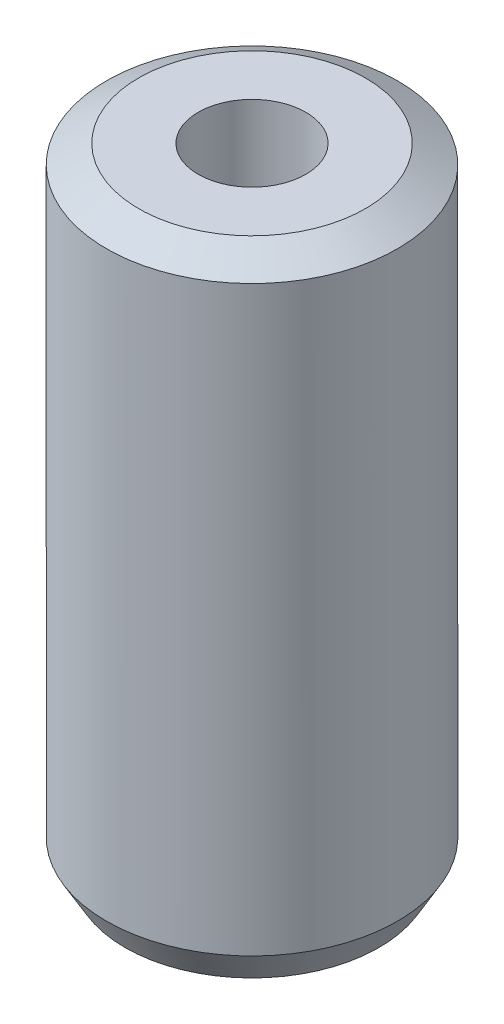
ISO-10303-21;
HEADER;
FILE_DESCRIPTION(('STEP AP214'),'2;1');
FILE_NAME('part.step','',(''),(''),'','','');
FILE_SCHEMA(('AUTOMOTIVE_DESIGN { 1 0 10303 214 1 1 1 1 }'));
ENDSEC;
DATA;
#1=APPLICATION_CONTEXT('core data for automotive mechanical design processes');
#2=APPLICATION_PROTOCOL_DEFINITION('international standard','automotive_design',2000,#1);
#3=PRODUCT_CONTEXT('',#1,'mechanical');
#4=PRODUCT('Part','Part','',(#3));
#5=PRODUCT_RELATED_PRODUCT_CATEGORY('part','',(#4));
#6=PRODUCT_DEFINITION_FORMATION('','',#4);
#7=PRODUCT_DEFINITION_CONTEXT('part definition',#1,'design');
#8=PRODUCT_DEFINITION('design','',#6,#7);
#9=PRODUCT_DEFINITION_SHAPE('','',#8);
#10=(LENGTH_UNIT() NAMED_UNIT(*) SI_UNIT(.MILLI.,.METRE.));
#11=(NAMED_UNIT(*) PLANE_ANGLE_UNIT() SI_UNIT($,.RADIAN.));
#12=(NAMED_UNIT(*) SI_UNIT($,.STERADIAN.) SOLID_ANGLE_UNIT());
#13=UNCERTAINTY_MEASURE_WITH_UNIT(LENGTH_MEASURE(1.E-05),#10,'distance_accuracy_value','');
#14=(GEOMETRIC_REPRESENTATION_CONTEXT(3) GLOBAL_UNCERTAINTY_ASSIGNED_CONTEXT((#13)) GLOBAL_UNIT_ASSIGNED_CONTEXT((#10,
#11,#12)) REPRESENTATION_CONTEXT('',''));
#15=CARTESIAN_POINT('',(0.,0.,0.));
#16=DIRECTION('',(0.,0.,1.));
#17=DIRECTION('',(1.,0.,0.));
#18=AXIS2_PLACEMENT_3D('',#15,#16,#17);
#19=CARTESIAN_POINT('',(0.,65.2591852957478,0.));
#20=DIRECTION('',(0.,-1.,0.));
#21=DIRECTION('',(0.,0.,-1.));
#22=AXIS2_PLACEMENT_3D('',#19,#20,#21);
#23=CYLINDRICAL_SURFACE('',#22,15.);
#24=CARTESIAN_POINT('',(0.,63.3434312101583,0.));
#25=DIRECTION('',(0.,1.,0.));
#26=DIRECTION('',(0.,0.,1.));
#27=AXIS2_PLACEMENT_3D('',#24,#25,#26);
#28=CIRCLE('',#27,15.);
#29=CARTESIAN_POINT('',(0.,63.3434312101582,-15.));
#30=VERTEX_POINT('',#29);
#31=EDGE_CURVE('E50',#30,#30,#28,.F.);
#32=ORIENTED_EDGE('',*,*,#31,.T.);
#33=EDGE_LOOP('',(#32));
#34=FACE_BOUND('',#33,.T.);
#35=CARTESIAN_POINT('',(0.,3.31818341104873,0.));
#36=DIRECTION('',(0.,1.,0.));
#37=DIRECTION('',(0.,0.,1.));
#38=AXIS2_PLACEMENT_3D('',#35,#36,#37);
#39=CIRCLE('',#38,15.);
#40=CARTESIAN_POINT('',(0.,3.31818341104873,15.));
#41=VERTEX_POINT('',#40);
#42=EDGE_CURVE('E51',#41,#41,#39,.T.);
#43=ORIENTED_EDGE('',*,*,#42,.T.);
#44=EDGE_LOOP('',(#43));
#45=FACE_BOUND('',#44,.T.);
#46=ADVANCED_FACE('F39',(#34,#45),#23,.T.);
#47=CARTESIAN_POINT('',(0.,65.2591852957478,0.));
#48=DIRECTION('',(0.,1.,0.));
#49=DIRECTION('',(0.,0.,1.));
#50=AXIS2_PLACEMENT_3D('',#47,#48,#49);
#51=PLANE('',#50);
#52=CARTESIAN_POINT('',(0.,65.2591852957478,0.));
#53=DIRECTION('',(0.,1.,0.));
#54=DIRECTION('',(0.,0.,1.));
#55=AXIS2_PLACEMENT_3D('',#52,#53,#54);
#56=CIRCLE('',#55,11.6818165889513);
#57=CARTESIAN_POINT('',(0.,65.2591852957478,-11.6818165889513));
#58=VERTEX_POINT('',#57);
#59=EDGE_CURVE('E54',#58,#58,#56,.T.);
#60=ORIENTED_EDGE('',*,*,#59,.T.);
#61=EDGE_LOOP('',(#60));
#62=FACE_BOUND('',#61,.T.);
#63=CARTESIAN_POINT('',(0.,65.2591852957478,0.));
#64=DIRECTION('',(0.,1.,0.));
#65=DIRECTION('',(0.,0.,1.));
#66=AXIS2_PLACEMENT_3D('',#63,#64,#65);
#67=CIRCLE('',#66,5.54728378747253);
#68=CARTESIAN_POINT('',(0.,65.2591852957478,5.54728378747253));
#69=VERTEX_POINT('',#68);
#70=EDGE_CURVE('E58',#69,#69,#67,.T.);
#71=ORIENTED_EDGE('',*,*,#70,.F.);
#72=EDGE_LOOP('',(#71));
#73=FACE_BOUND('',#72,.T.);
#74=ADVANCED_FACE('F69',(#62,#73),#51,.T.);
#75=CARTESIAN_POINT('',(0.,0.,0.));
#76=DIRECTION('',(0.,1.,0.));
#77=DIRECTION('',(0.,0.,1.));
#78=AXIS2_PLACEMENT_3D('',#75,#76,#77);
#79=PLANE('',#78);
#80=CARTESIAN_POINT('',(0.,0.,0.));
#81=DIRECTION('',(0.,1.,0.));
#82=DIRECTION('',(0.,0.,1.));
#83=AXIS2_PLACEMENT_3D('',#80,#81,#82);
#84=CIRCLE('',#83,13.0842459144105);
#85=CARTESIAN_POINT('',(0.,0.,13.0842459144105));
#86=VERTEX_POINT('',#85);
#87=EDGE_CURVE('E10',#86,#86,#84,.F.);
#88=ORIENTED_EDGE('',*,*,#87,.T.);
#89=EDGE_LOOP('',(#88));
#90=FACE_BOUND('',#89,.T.);
#91=CARTESIAN_POINT('',(0.,0.,0.));
#92=DIRECTION('',(0.,1.,0.));
#93=DIRECTION('',(0.,0.,1.));
#94=AXIS2_PLACEMENT_3D('',#91,#92,#93);
#95=CIRCLE('',#94,5.54728378747253);
#96=CARTESIAN_POINT('',(0.,0.,5.54728378747253));
#97=VERTEX_POINT('',#96);
#98=EDGE_CURVE('E63',#97,#97,#95,.T.);
#99=ORIENTED_EDGE('',*,*,#98,.T.);
#100=EDGE_LOOP('',(#99));
#101=FACE_BOUND('',#100,.T.);
#102=ADVANCED_FACE('F75',(#90,#101),#79,.F.);
#103=CARTESIAN_POINT('',(0.,65.2591852957478,0.));
#104=DIRECTION('',(0.,-1.,0.));
#105=DIRECTION('',(0.,0.,-1.));
#106=AXIS2_PLACEMENT_3D('',#103,#104,#105);
#107=CYLINDRICAL_SURFACE('',#106,5.54728378747253);
#108=ORIENTED_EDGE('',*,*,#70,.T.);
#109=EDGE_LOOP('',(#108));
#110=FACE_BOUND('',#109,.T.);
#111=ORIENTED_EDGE('',*,*,#98,.F.);
#112=EDGE_LOOP('',(#111));
#113=FACE_BOUND('',#112,.T.);
#114=ADVANCED_FACE('F70',(#110,#113),#107,.F.);
#115=CARTESIAN_POINT('',(0.,65.2591852957478,0.));
#116=DIRECTION('',(0.,-1.,0.));
#117=DIRECTION('',(0.,0.,-1.));
#118=AXIS2_PLACEMENT_3D('',#115,#116,#117);
#119=CONICAL_SURFACE('',#118,11.6818165889513,1.04719755119659);
#120=CARTESIAN_POINT('',(0.,63.3434312101582,-15.));
#121=CARTESIAN_POINT('',(0.,63.3633869818831,-14.9654355894683));
#122=CARTESIAN_POINT('',(0.,63.383342753608,-14.9308711789365));
#123=CARTESIAN_POINT('',(0.,63.4232542970578,-14.861742357873));
#124=CARTESIAN_POINT('',(0.,63.4432100687827,-14.8271779473412));
#125=CARTESIAN_POINT('',(0.,63.4831216122325,-14.7580491262777));
#126=CARTESIAN_POINT('',(0.,63.5030773839574,-14.723484715746));
#127=CARTESIAN_POINT('',(0.,63.5429889274072,-14.6543558946824));
#128=CARTESIAN_POINT('',(0.,63.5629446991321,-14.6197914841507));
#129=CARTESIAN_POINT('',(0.,63.6028562425818,-14.5506626630872));
#130=CARTESIAN_POINT('',(0.,63.6228120143067,-14.5160982525554));
#131=CARTESIAN_POINT('',(0.,63.6627235577565,-14.4469694314919));
#132=CARTESIAN_POINT('',(0.,63.6826793294814,-14.4124050209601));
#133=CARTESIAN_POINT('',(0.,63.7225908729312,-14.3432761998966));
#134=CARTESIAN_POINT('',(0.,63.7425466446561,-14.3087117893649));
#135=CARTESIAN_POINT('',(0.,63.7824581881059,-14.2395829683013));
#136=CARTESIAN_POINT('',(0.,63.8024139598307,-14.2050185577696));
#137=CARTESIAN_POINT('',(0.,63.8423255032805,-14.1358897367061));
#138=CARTESIAN_POINT('',(0.,63.8622812750054,-14.1013253261743));
#139=CARTESIAN_POINT('',(0.,63.9021928184552,-14.0321965051108));
#140=CARTESIAN_POINT('',(0.,63.9221485901801,-13.997632094579));
#141=CARTESIAN_POINT('',(0.,63.9620601336299,-13.9285032735155));
#142=CARTESIAN_POINT('',(0.,63.9820159053548,-13.8939388629838));
#143=CARTESIAN_POINT('',(0.,64.0219274488046,-13.8248100419202));
#144=CARTESIAN_POINT('',(0.,64.0418832205294,-13.7902456313885));
#145=CARTESIAN_POINT('',(0.,64.0817947639792,-13.721116810325));
#146=CARTESIAN_POINT('',(0.,64.1017505357041,-13.6865523997932));
#147=CARTESIAN_POINT('',(0.,64.1416620791539,-13.6174235787297));
#148=CARTESIAN_POINT('',(0.,64.1616178508788,-13.5828591681979));
#149=CARTESIAN_POINT('',(0.,64.2015293943286,-13.5137303471344));
#150=CARTESIAN_POINT('',(0.,64.2214851660535,-13.4791659366027));
#151=CARTESIAN_POINT('',(0.,64.2613967095032,-13.4100371155392));
#152=CARTESIAN_POINT('',(0.,64.2813524812281,-13.3754727050074));
#153=CARTESIAN_POINT('',(0.,64.3212640246779,-13.3063438839439));
#154=CARTESIAN_POINT('',(0.,64.3412197964028,-13.2717794734121));
#155=CARTESIAN_POINT('',(0.,64.3811313398526,-13.2026506523486));
#156=CARTESIAN_POINT('',(0.,64.4010871115775,-13.1680862418169));
#157=CARTESIAN_POINT('',(0.,64.4409986550273,-13.0989574207533));
#158=CARTESIAN_POINT('',(0.,64.4609544267522,-13.0643930102216));
#159=CARTESIAN_POINT('',(0.,64.5008659702019,-12.9952641891581));
#160=CARTESIAN_POINT('',(0.,64.5208217419268,-12.9606997786263));
#161=CARTESIAN_POINT('',(0.,64.5607332853766,-12.8915709575628));
#162=CARTESIAN_POINT('',(0.,64.5806890571015,-12.857006547031));
#163=CARTESIAN_POINT('',(0.,64.6206006005513,-12.7878777259675));
#164=CARTESIAN_POINT('',(0.,64.6405563722762,-12.7533133154358));
#165=CARTESIAN_POINT('',(0.,64.680467915726,-12.6841844943722));
#166=CARTESIAN_POINT('',(0.,64.7004236874509,-12.6496200838405));
#167=CARTESIAN_POINT('',(0.,64.7403352309006,-12.580491262777));
#168=CARTESIAN_POINT('',(0.,64.7602910026255,-12.5459268522452));
#169=CARTESIAN_POINT('',(0.,64.8002025460753,-12.4767980311817));
#170=CARTESIAN_POINT('',(0.,64.8201583178002,-12.4422336206499));
#171=CARTESIAN_POINT('',(0.,64.86006986125,-12.3731047995864));
#172=CARTESIAN_POINT('',(0.,64.8800256329749,-12.3385403890547));
#173=CARTESIAN_POINT('',(0.,64.9199371764247,-12.2694115679912));
#174=CARTESIAN_POINT('',(0.,64.9398929481495,-12.2348471574594));
#175=CARTESIAN_POINT('',(0.,64.9798044915993,-12.1657183363959));
#176=CARTESIAN_POINT('',(0.,64.9997602633242,-12.1311539258641));
#177=CARTESIAN_POINT('',(0.,65.039671806774,-12.0620251048006));
#178=CARTESIAN_POINT('',(0.,65.0596275784989,-12.0274606942689));
#179=CARTESIAN_POINT('',(0.,65.0995391219487,-11.9583318732053));
#180=CARTESIAN_POINT('',(0.,65.1194948936736,-11.9237674626736));
#181=CARTESIAN_POINT('',(0.,65.1594064371234,-11.8546386416101));
#182=CARTESIAN_POINT('',(0.,65.1793622088482,-11.8200742310783));
#183=CARTESIAN_POINT('',(0.,65.219273752298,-11.7509454100148));
#184=CARTESIAN_POINT('',(0.,65.2392295240229,-11.716380999483));
#185=CARTESIAN_POINT('',(0.,65.2591852957478,-11.6818165889513));
#186=B_SPLINE_CURVE_WITH_KNOTS('',3,(#120,#121,#122,#123,#124,#125,#126,#127,#128,#129,#130,
#131,#132,#133,#134,#135,#136,#137,#138,#139,#140,#141,#142,#143,#144,#145,#146,#147,#148,#149,
#150,#151,#152,#153,#154,#155,#156,#157,#158,#159,#160,#161,#162,#163,#164,#165,#166,#167,#168,
#169,#170,#171,#172,#173,#174,#175,#176,#177,#178,#179,#180,#181,#182,#183,#184,#185),
.UNSPECIFIED.,.F.,.F.,(4,2,2,2,2,2,2,2,2,2,2,2,2,2,2,2,2,2,2,2,2,2,2,2,2,2,2,2,2,2,2,2,4),(0.,
0.119734630349352,0.239469260698696,0.35920389104804,0.478938521397393,0.598673151746737,
0.71840778209608,0.838142412445431,0.957877042794777,1.07761167314412,1.19734630349347,
1.31708093384282,1.43681556419216,1.55655019454151,1.67628482489086,1.7960194552402,
1.91575408558955,2.0354887159389,2.15522334628824,2.27495797663759,2.39469260698694,
2.51442723733628,2.63416186768563,2.75389649803498,2.87363112838432,2.99336575873367,
3.11310038908302,3.23283501943236,3.35256964978171,3.47230428013106,3.5920389104804,
3.71177354082975,3.8315081711791),.UNSPECIFIED.);
#187=EDGE_CURVE('BSEAM81',#30,#58,#186,.T.);
#188=ORIENTED_EDGE('',*,*,#31,.F.);
#189=ORIENTED_EDGE('',*,*,#59,.F.);
#190=ORIENTED_EDGE('',*,*,#187,.T.);
#191=ORIENTED_EDGE('',*,*,#187,.F.);
#192=EDGE_LOOP('',(#188,#190,#189,#191));
#193=FACE_BOUND('',#192,.T.);
#194=ADVANCED_FACE('F81',(#193),#119,.T.);
#195=CARTESIAN_POINT('',(0.,3.31818341104873,0.));
#196=DIRECTION('',(0.,1.,0.));
#197=DIRECTION('',(0.,0.,1.));
#198=AXIS2_PLACEMENT_3D('',#195,#196,#197);
#199=CONICAL_SURFACE('',#198,15.,0.523598775598302);
#200=ORIENTED_EDGE('',*,*,#87,.F.);
#201=EDGE_LOOP('',(#200));
#202=FACE_BOUND('',#201,.T.);
#203=ORIENTED_EDGE('',*,*,#42,.F.);
#204=EDGE_LOOP('',(#203));
#205=FACE_BOUND('',#204,.T.);
#206=ADVANCED_FACE('F45',(#202,#205),#199,.T.);
#207=CLOSED_SHELL('',(#46,#74,#102,#114,#194,#206));
#208=MANIFOLD_SOLID_BREP('B2',#207);
#209=ADVANCED_BREP_SHAPE_REPRESENTATION('',(#18,#208),#14);
#210=SHAPE_DEFINITION_REPRESENTATION(#9,#209);
ENDSEC;
END-ISO-10303-21;
